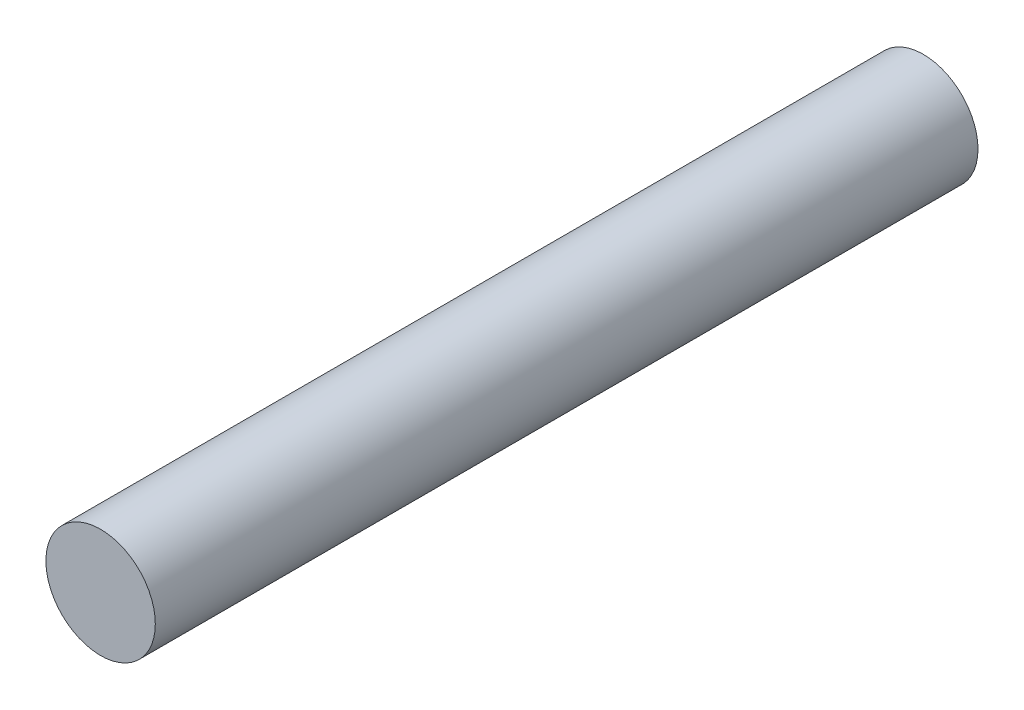
ISO-10303-21;
HEADER;
FILE_DESCRIPTION(('STEP AP214'),'2;1');
FILE_NAME('part.step','',(''),(''),'','','');
FILE_SCHEMA(('AUTOMOTIVE_DESIGN { 1 0 10303 214 1 1 1 1 }'));
ENDSEC;
DATA;
#1=APPLICATION_CONTEXT('core data for automotive mechanical design processes');
#2=APPLICATION_PROTOCOL_DEFINITION('international standard','automotive_design',2000,#1);
#3=PRODUCT_CONTEXT('',#1,'mechanical');
#4=PRODUCT('Part','Part','',(#3));
#5=PRODUCT_RELATED_PRODUCT_CATEGORY('part','',(#4));
#6=PRODUCT_DEFINITION_FORMATION('','',#4);
#7=PRODUCT_DEFINITION_CONTEXT('part definition',#1,'design');
#8=PRODUCT_DEFINITION('design','',#6,#7);
#9=PRODUCT_DEFINITION_SHAPE('','',#8);
#10=(LENGTH_UNIT() NAMED_UNIT(*) SI_UNIT(.MILLI.,.METRE.));
#11=(NAMED_UNIT(*) PLANE_ANGLE_UNIT() SI_UNIT($,.RADIAN.));
#12=(NAMED_UNIT(*) SI_UNIT($,.STERADIAN.) SOLID_ANGLE_UNIT());
#13=UNCERTAINTY_MEASURE_WITH_UNIT(LENGTH_MEASURE(1.E-05),#10,'distance_accuracy_value','');
#14=(GEOMETRIC_REPRESENTATION_CONTEXT(3) GLOBAL_UNCERTAINTY_ASSIGNED_CONTEXT((#13)) GLOBAL_UNIT_ASSIGNED_CONTEXT((#10,
#11,#12)) REPRESENTATION_CONTEXT('',''));
#15=CARTESIAN_POINT('',(0.,0.,0.));
#16=DIRECTION('',(0.,0.,1.));
#17=DIRECTION('',(1.,0.,0.));
#18=AXIS2_PLACEMENT_3D('',#15,#16,#17);
#19=CARTESIAN_POINT('',(-7.80473556806994,1.21600118546991,60.));
#20=DIRECTION('',(0.,0.,-1.));
#21=DIRECTION('',(-1.,0.,0.));
#22=AXIS2_PLACEMENT_3D('',#19,#20,#21);
#23=CYLINDRICAL_SURFACE('',#22,3.99);
#24=CARTESIAN_POINT('',(-7.80473556806994,1.21600118546991,60.));
#25=DIRECTION('',(0.,0.,1.));
#26=DIRECTION('',(1.,0.,0.));
#27=AXIS2_PLACEMENT_3D('',#24,#25,#26);
#28=CIRCLE('',#27,3.99);
#29=CARTESIAN_POINT('',(-3.81473556806994,1.21600118546991,60.));
#30=VERTEX_POINT('',#29);
#31=EDGE_CURVE('E10',#30,#30,#28,.T.);
#32=ORIENTED_EDGE('',*,*,#31,.F.);
#33=EDGE_LOOP('',(#32));
#34=FACE_BOUND('',#33,.T.);
#35=CARTESIAN_POINT('',(-7.80473556806994,1.21600118546991,0.));
#36=DIRECTION('',(0.,0.,1.));
#37=DIRECTION('',(1.,0.,0.));
#38=AXIS2_PLACEMENT_3D('',#35,#36,#37);
#39=CIRCLE('',#38,3.99);
#40=CARTESIAN_POINT('',(-3.81473556806994,1.21600118546991,0.));
#41=VERTEX_POINT('',#40);
#42=EDGE_CURVE('E34',#41,#41,#39,.T.);
#43=ORIENTED_EDGE('',*,*,#42,.T.);
#44=EDGE_LOOP('',(#43));
#45=FACE_BOUND('',#44,.T.);
#46=ADVANCED_FACE('F31',(#34,#45),#23,.T.);
#47=CARTESIAN_POINT('',(-7.80473556806994,1.21600118546991,60.));
#48=DIRECTION('',(0.,0.,1.));
#49=DIRECTION('',(1.,0.,0.));
#50=AXIS2_PLACEMENT_3D('',#47,#48,#49);
#51=PLANE('',#50);
#52=ORIENTED_EDGE('',*,*,#31,.T.);
#53=EDGE_LOOP('',(#52));
#54=FACE_BOUND('',#53,.T.);
#55=ADVANCED_FACE('F46',(#54),#51,.T.);
#56=CARTESIAN_POINT('',(-7.80473556806994,1.21600118546991,0.));
#57=DIRECTION('',(0.,0.,1.));
#58=DIRECTION('',(1.,0.,0.));
#59=AXIS2_PLACEMENT_3D('',#56,#57,#58);
#60=PLANE('',#59);
#61=ORIENTED_EDGE('',*,*,#42,.F.);
#62=EDGE_LOOP('',(#61));
#63=FACE_BOUND('',#62,.T.);
#64=ADVANCED_FACE('F44',(#63),#60,.F.);
#65=CLOSED_SHELL('',(#46,#55,#64));
#66=MANIFOLD_SOLID_BREP('B2',#65);
#67=ADVANCED_BREP_SHAPE_REPRESENTATION('',(#18,#66),#14);
#68=SHAPE_DEFINITION_REPRESENTATION(#9,#67);
ENDSEC;
END-ISO-10303-21;
